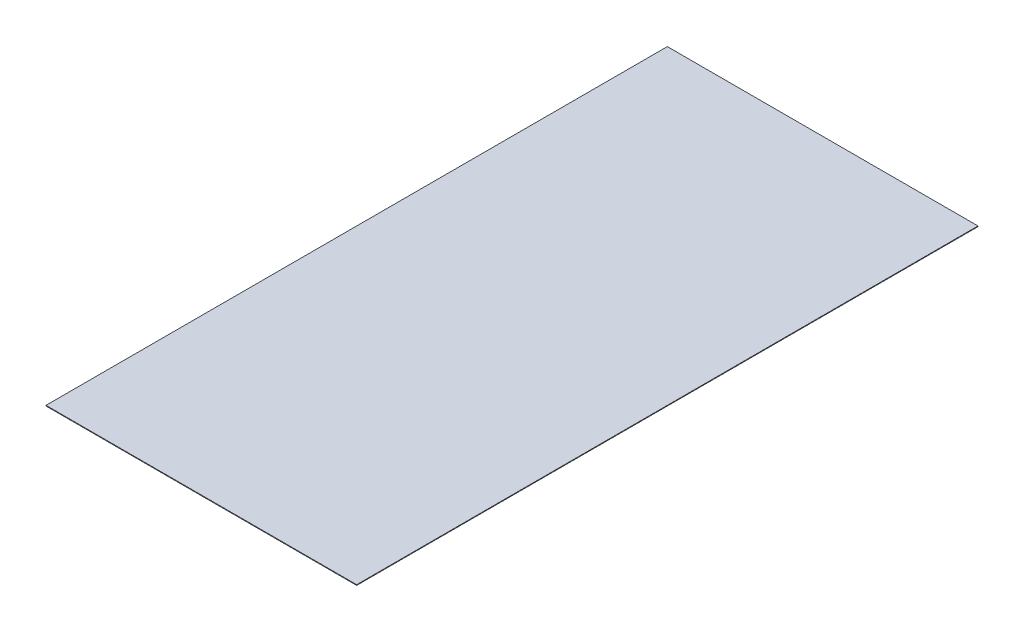
ISO-10303-21;
HEADER;
FILE_DESCRIPTION(('STEP AP214'),'2;1');
FILE_NAME('part.step','',(''),(''),'','','');
FILE_SCHEMA(('AUTOMOTIVE_DESIGN { 1 0 10303 214 1 1 1 1 }'));
ENDSEC;
DATA;
#1=APPLICATION_CONTEXT('core data for automotive mechanical design processes');
#2=APPLICATION_PROTOCOL_DEFINITION('international standard','automotive_design',2000,#1);
#3=PRODUCT_CONTEXT('',#1,'mechanical');
#4=PRODUCT('Part','Part','',(#3));
#5=PRODUCT_RELATED_PRODUCT_CATEGORY('part','',(#4));
#6=PRODUCT_DEFINITION_FORMATION('','',#4);
#7=PRODUCT_DEFINITION_CONTEXT('part definition',#1,'design');
#8=PRODUCT_DEFINITION('design','',#6,#7);
#9=PRODUCT_DEFINITION_SHAPE('','',#8);
#10=(LENGTH_UNIT() NAMED_UNIT(*) SI_UNIT(.MILLI.,.METRE.));
#11=(NAMED_UNIT(*) PLANE_ANGLE_UNIT() SI_UNIT($,.RADIAN.));
#12=(NAMED_UNIT(*) SI_UNIT($,.STERADIAN.) SOLID_ANGLE_UNIT());
#13=UNCERTAINTY_MEASURE_WITH_UNIT(LENGTH_MEASURE(1.E-05),#10,'distance_accuracy_value','');
#14=(GEOMETRIC_REPRESENTATION_CONTEXT(3) GLOBAL_UNCERTAINTY_ASSIGNED_CONTEXT((#13)) GLOBAL_UNIT_ASSIGNED_CONTEXT((#10,
#11,#12)) REPRESENTATION_CONTEXT('',''));
#15=CARTESIAN_POINT('',(0.,0.,0.));
#16=DIRECTION('',(0.,0.,1.));
#17=DIRECTION('',(1.,0.,0.));
#18=AXIS2_PLACEMENT_3D('',#15,#16,#17);
#19=CARTESIAN_POINT('',(-25.,0.1,0.));
#20=DIRECTION('',(1.,0.,0.));
#21=DIRECTION('',(0.,0.,-1.));
#22=AXIS2_PLACEMENT_3D('',#19,#20,#21);
#23=PLANE('',#22);
#24=DIRECTION('',(0.,0.,1.));
#25=VECTOR('',#24,1.);
#26=CARTESIAN_POINT('',(-25.,0.,0.));
#27=LINE('',#26,#25);
#28=CARTESIAN_POINT('',(-25.,0.,0.));
#29=VERTEX_POINT('',#28);
#30=CARTESIAN_POINT('',(-25.,0.,100.));
#31=VERTEX_POINT('',#30);
#32=EDGE_CURVE('E98',#29,#31,#27,.T.);
#33=ORIENTED_EDGE('',*,*,#32,.T.);
#34=DIRECTION('',(0.,-1.,0.));
#35=VECTOR('',#34,1.);
#36=CARTESIAN_POINT('',(-25.,0.1,100.));
#37=LINE('',#36,#35);
#38=CARTESIAN_POINT('',(-25.,0.1,100.));
#39=VERTEX_POINT('',#38);
#40=EDGE_CURVE('E11',#39,#31,#37,.T.);
#41=ORIENTED_EDGE('',*,*,#40,.F.);
#42=DIRECTION('',(0.,0.,1.));
#43=VECTOR('',#42,1.);
#44=CARTESIAN_POINT('',(-25.,0.1,0.));
#45=LINE('',#44,#43);
#46=CARTESIAN_POINT('',(-25.,0.1,0.));
#47=VERTEX_POINT('',#46);
#48=EDGE_CURVE('E86',#47,#39,#45,.T.);
#49=ORIENTED_EDGE('',*,*,#48,.F.);
#50=DIRECTION('',(0.,-1.,0.));
#51=VECTOR('',#50,1.);
#52=CARTESIAN_POINT('',(-25.,0.1,0.));
#53=LINE('',#52,#51);
#54=EDGE_CURVE('E94',#47,#29,#53,.T.);
#55=ORIENTED_EDGE('',*,*,#54,.T.);
#56=EDGE_LOOP('',(#33,#41,#49,#55));
#57=FACE_BOUND('',#56,.T.);
#58=ADVANCED_FACE('F35',(#57),#23,.F.);
#59=CARTESIAN_POINT('',(-25.,0.1,100.));
#60=DIRECTION('',(0.,0.,-1.));
#61=DIRECTION('',(-1.,0.,0.));
#62=AXIS2_PLACEMENT_3D('',#59,#60,#61);
#63=PLANE('',#62);
#64=DIRECTION('',(1.,0.,0.));
#65=VECTOR('',#64,1.);
#66=CARTESIAN_POINT('',(-25.,0.,100.));
#67=LINE('',#66,#65);
#68=CARTESIAN_POINT('',(25.,0.,100.));
#69=VERTEX_POINT('',#68);
#70=EDGE_CURVE('E90',#31,#69,#67,.T.);
#71=ORIENTED_EDGE('',*,*,#70,.T.);
#72=DIRECTION('',(0.,-1.,0.));
#73=VECTOR('',#72,1.);
#74=CARTESIAN_POINT('',(25.,0.1,100.));
#75=LINE('',#74,#73);
#76=CARTESIAN_POINT('',(25.,0.1,100.));
#77=VERTEX_POINT('',#76);
#78=EDGE_CURVE('E43',#77,#69,#75,.T.);
#79=ORIENTED_EDGE('',*,*,#78,.F.);
#80=DIRECTION('',(1.,0.,0.));
#81=VECTOR('',#80,1.);
#82=CARTESIAN_POINT('',(-25.,0.1,100.));
#83=LINE('',#82,#81);
#84=EDGE_CURVE('E81',#39,#77,#83,.T.);
#85=ORIENTED_EDGE('',*,*,#84,.F.);
#86=ORIENTED_EDGE('',*,*,#40,.T.);
#87=EDGE_LOOP('',(#71,#79,#85,#86));
#88=FACE_BOUND('',#87,.T.);
#89=ADVANCED_FACE('F89',(#88),#63,.F.);
#90=CARTESIAN_POINT('',(25.,0.1,0.));
#91=DIRECTION('',(-1.,0.,0.));
#92=DIRECTION('',(0.,0.,1.));
#93=AXIS2_PLACEMENT_3D('',#90,#91,#92);
#94=PLANE('',#93);
#95=DIRECTION('',(0.,0.,-1.));
#96=VECTOR('',#95,1.);
#97=CARTESIAN_POINT('',(25.,0.,0.));
#98=LINE('',#97,#96);
#99=CARTESIAN_POINT('',(25.,0.,0.));
#100=VERTEX_POINT('',#99);
#101=EDGE_CURVE('E68',#69,#100,#98,.T.);
#102=ORIENTED_EDGE('',*,*,#101,.T.);
#103=DIRECTION('',(0.,-1.,0.));
#104=VECTOR('',#103,1.);
#105=CARTESIAN_POINT('',(25.,0.1,0.));
#106=LINE('',#105,#104);
#107=CARTESIAN_POINT('',(25.,0.1,0.));
#108=VERTEX_POINT('',#107);
#109=EDGE_CURVE('E91',#108,#100,#106,.T.);
#110=ORIENTED_EDGE('',*,*,#109,.F.);
#111=DIRECTION('',(0.,0.,-1.));
#112=VECTOR('',#111,1.);
#113=CARTESIAN_POINT('',(25.,0.1,0.));
#114=LINE('',#113,#112);
#115=EDGE_CURVE('E84',#77,#108,#114,.T.);
#116=ORIENTED_EDGE('',*,*,#115,.F.);
#117=ORIENTED_EDGE('',*,*,#78,.T.);
#118=EDGE_LOOP('',(#102,#110,#116,#117));
#119=FACE_BOUND('',#118,.T.);
#120=ADVANCED_FACE('F92',(#119),#94,.F.);
#121=CARTESIAN_POINT('',(-25.,0.1,0.));
#122=DIRECTION('',(0.,0.,1.));
#123=DIRECTION('',(1.,0.,0.));
#124=AXIS2_PLACEMENT_3D('',#121,#122,#123);
#125=PLANE('',#124);
#126=DIRECTION('',(-1.,0.,0.));
#127=VECTOR('',#126,1.);
#128=CARTESIAN_POINT('',(-25.,0.,0.));
#129=LINE('',#128,#127);
#130=EDGE_CURVE('E74',#100,#29,#129,.T.);
#131=ORIENTED_EDGE('',*,*,#130,.T.);
#132=ORIENTED_EDGE('',*,*,#54,.F.);
#133=DIRECTION('',(-1.,0.,0.));
#134=VECTOR('',#133,1.);
#135=CARTESIAN_POINT('',(-25.,0.1,0.));
#136=LINE('',#135,#134);
#137=EDGE_CURVE('E51',#108,#47,#136,.T.);
#138=ORIENTED_EDGE('',*,*,#137,.F.);
#139=ORIENTED_EDGE('',*,*,#109,.T.);
#140=EDGE_LOOP('',(#131,#132,#138,#139));
#141=FACE_BOUND('',#140,.T.);
#142=ADVANCED_FACE('F105',(#141),#125,.F.);
#143=CARTESIAN_POINT('',(0.,0.1,0.));
#144=DIRECTION('',(0.,1.,0.));
#145=DIRECTION('',(0.,0.,1.));
#146=AXIS2_PLACEMENT_3D('',#143,#144,#145);
#147=PLANE('',#146);
#148=ORIENTED_EDGE('',*,*,#48,.T.);
#149=ORIENTED_EDGE('',*,*,#84,.T.);
#150=ORIENTED_EDGE('',*,*,#115,.T.);
#151=ORIENTED_EDGE('',*,*,#137,.T.);
#152=EDGE_LOOP('',(#148,#149,#150,#151));
#153=FACE_BOUND('',#152,.T.);
#154=ADVANCED_FACE('F82',(#153),#147,.T.);
#155=CARTESIAN_POINT('',(0.,0.,0.));
#156=DIRECTION('',(0.,1.,0.));
#157=DIRECTION('',(0.,0.,1.));
#158=AXIS2_PLACEMENT_3D('',#155,#156,#157);
#159=PLANE('',#158);
#160=ORIENTED_EDGE('',*,*,#32,.F.);
#161=ORIENTED_EDGE('',*,*,#130,.F.);
#162=ORIENTED_EDGE('',*,*,#101,.F.);
#163=ORIENTED_EDGE('',*,*,#70,.F.);
#164=EDGE_LOOP('',(#160,#161,#162,#163));
#165=FACE_BOUND('',#164,.T.);
#166=ADVANCED_FACE('F108',(#165),#159,.F.);
#167=CLOSED_SHELL('',(#58,#89,#120,#142,#154,#166));
#168=MANIFOLD_SOLID_BREP('B2',#167);
#169=ADVANCED_BREP_SHAPE_REPRESENTATION('',(#18,#168),#14);
#170=SHAPE_DEFINITION_REPRESENTATION(#9,#169);
ENDSEC;
END-ISO-10303-21;
